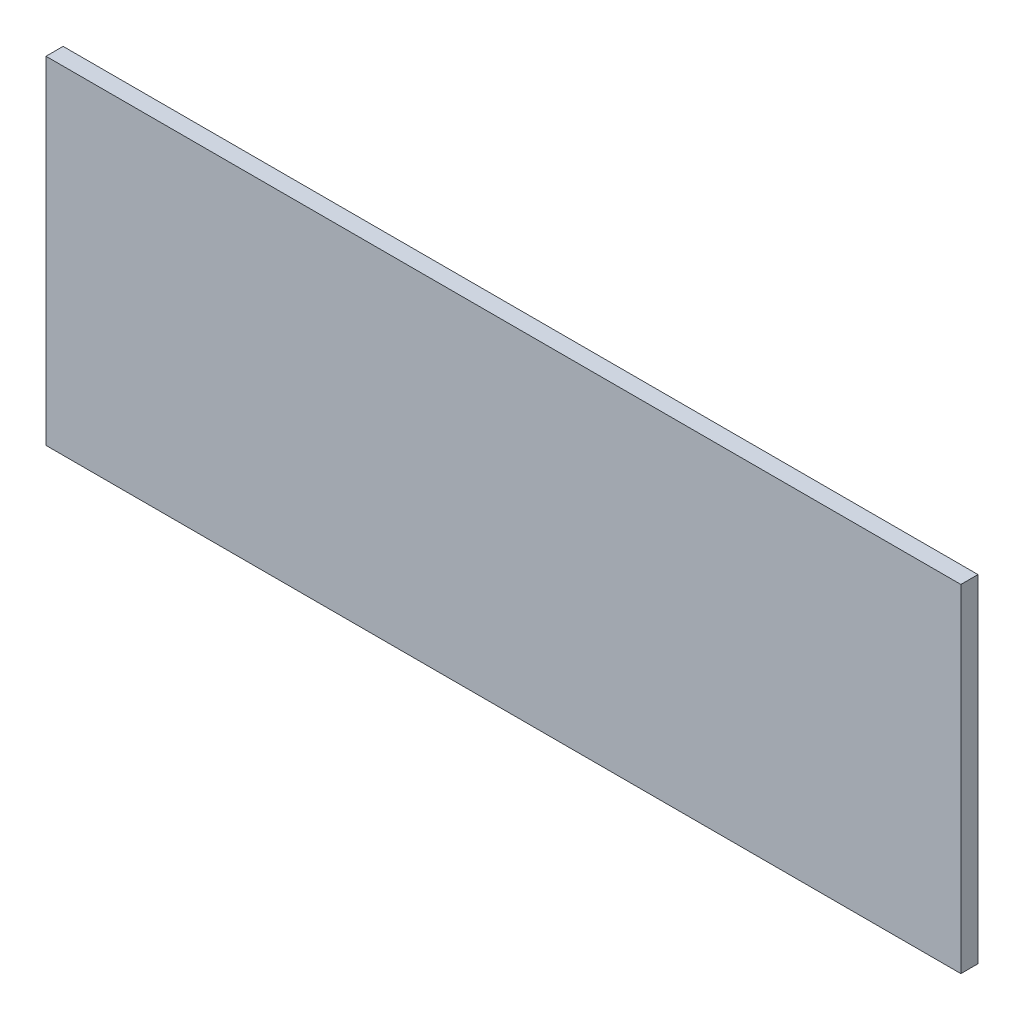
ISO-10303-21;
HEADER;
FILE_DESCRIPTION(('STEP AP214'),'2;1');
FILE_NAME('part.step','',(''),(''),'','','');
FILE_SCHEMA(('AUTOMOTIVE_DESIGN { 1 0 10303 214 1 1 1 1 }'));
ENDSEC;
DATA;
#1=APPLICATION_CONTEXT('core data for automotive mechanical design processes');
#2=APPLICATION_PROTOCOL_DEFINITION('international standard','automotive_design',2000,#1);
#3=PRODUCT_CONTEXT('',#1,'mechanical');
#4=PRODUCT('Part','Part','',(#3));
#5=PRODUCT_RELATED_PRODUCT_CATEGORY('part','',(#4));
#6=PRODUCT_DEFINITION_FORMATION('','',#4);
#7=PRODUCT_DEFINITION_CONTEXT('part definition',#1,'design');
#8=PRODUCT_DEFINITION('design','',#6,#7);
#9=PRODUCT_DEFINITION_SHAPE('','',#8);
#10=(LENGTH_UNIT() NAMED_UNIT(*) SI_UNIT(.MILLI.,.METRE.));
#11=(NAMED_UNIT(*) PLANE_ANGLE_UNIT() SI_UNIT($,.RADIAN.));
#12=(NAMED_UNIT(*) SI_UNIT($,.STERADIAN.) SOLID_ANGLE_UNIT());
#13=UNCERTAINTY_MEASURE_WITH_UNIT(LENGTH_MEASURE(1.E-05),#10,'distance_accuracy_value','');
#14=(GEOMETRIC_REPRESENTATION_CONTEXT(3) GLOBAL_UNCERTAINTY_ASSIGNED_CONTEXT((#13)) GLOBAL_UNIT_ASSIGNED_CONTEXT((#10,
#11,#12)) REPRESENTATION_CONTEXT('',''));
#15=CARTESIAN_POINT('',(0.,0.,0.));
#16=DIRECTION('',(0.,0.,1.));
#17=DIRECTION('',(1.,0.,0.));
#18=AXIS2_PLACEMENT_3D('',#15,#16,#17);
#19=CARTESIAN_POINT('',(96.5670013427734,58.8370018005371,0.));
#20=DIRECTION('',(0.,1.,0.));
#21=DIRECTION('',(1.,0.,0.));
#22=AXIS2_PLACEMENT_3D('',#19,#20,#21);
#23=PLANE('',#22);
#24=DIRECTION('',(1.,0.,0.));
#25=VECTOR('',#24,1.);
#26=CARTESIAN_POINT('',(96.5670013427734,58.8370018005371,0.03556));
#27=LINE('',#26,#25);
#28=CARTESIAN_POINT('',(96.5670013427734,58.8370018005371,0.03556));
#29=VERTEX_POINT('',#28);
#30=CARTESIAN_POINT('',(98.4670028686523,58.8370018005371,0.03556));
#31=VERTEX_POINT('',#30);
#32=EDGE_CURVE('E11',#29,#31,#27,.T.);
#33=ORIENTED_EDGE('',*,*,#32,.F.);
#34=DIRECTION('',(0.,0.,1.));
#35=VECTOR('',#34,1.);
#36=CARTESIAN_POINT('',(96.5670013427734,58.8370018005371,0.));
#37=LINE('',#36,#35);
#38=CARTESIAN_POINT('',(96.5670013427734,58.8370018005371,0.));
#39=VERTEX_POINT('',#38);
#40=EDGE_CURVE('E24',#39,#29,#37,.T.);
#41=ORIENTED_EDGE('',*,*,#40,.F.);
#42=DIRECTION('',(1.,0.,0.));
#43=VECTOR('',#42,1.);
#44=CARTESIAN_POINT('',(96.5670013427734,58.8370018005371,0.));
#45=LINE('',#44,#43);
#46=CARTESIAN_POINT('',(98.4670028686523,58.8370018005371,0.));
#47=VERTEX_POINT('',#46);
#48=EDGE_CURVE('E75',#39,#47,#45,.T.);
#49=ORIENTED_EDGE('',*,*,#48,.T.);
#50=DIRECTION('',(0.,0.,1.));
#51=VECTOR('',#50,1.);
#52=CARTESIAN_POINT('',(98.4670028686523,58.8370018005371,0.));
#53=LINE('',#52,#51);
#54=EDGE_CURVE('E37',#47,#31,#53,.T.);
#55=ORIENTED_EDGE('',*,*,#54,.T.);
#56=EDGE_LOOP('',(#33,#41,#49,#55));
#57=FACE_BOUND('',#56,.T.);
#58=ADVANCED_FACE('F17',(#57),#23,.F.);
#59=CARTESIAN_POINT('',(98.4670028686523,58.8370018005371,0.));
#60=DIRECTION('',(-1.,0.,0.));
#61=DIRECTION('',(0.,1.,0.));
#62=AXIS2_PLACEMENT_3D('',#59,#60,#61);
#63=PLANE('',#62);
#64=DIRECTION('',(0.,1.,0.));
#65=VECTOR('',#64,1.);
#66=CARTESIAN_POINT('',(98.4670028686523,58.8370018005371,0.03556));
#67=LINE('',#66,#65);
#68=CARTESIAN_POINT('',(98.4670028686523,59.5369987487793,0.03556));
#69=VERTEX_POINT('',#68);
#70=EDGE_CURVE('E83',#31,#69,#67,.T.);
#71=ORIENTED_EDGE('',*,*,#70,.F.);
#72=ORIENTED_EDGE('',*,*,#54,.F.);
#73=DIRECTION('',(0.,1.,0.));
#74=VECTOR('',#73,1.);
#75=CARTESIAN_POINT('',(98.4670028686523,58.8370018005371,0.));
#76=LINE('',#75,#74);
#77=CARTESIAN_POINT('',(98.4670028686523,59.5369987487793,0.));
#78=VERTEX_POINT('',#77);
#79=EDGE_CURVE('E81',#47,#78,#76,.T.);
#80=ORIENTED_EDGE('',*,*,#79,.T.);
#81=DIRECTION('',(0.,0.,1.));
#82=VECTOR('',#81,1.);
#83=CARTESIAN_POINT('',(98.4670028686523,59.5369987487793,0.));
#84=LINE('',#83,#82);
#85=EDGE_CURVE('E67',#78,#69,#84,.T.);
#86=ORIENTED_EDGE('',*,*,#85,.T.);
#87=EDGE_LOOP('',(#71,#72,#80,#86));
#88=FACE_BOUND('',#87,.T.);
#89=ADVANCED_FACE('F89',(#88),#63,.F.);
#90=CARTESIAN_POINT('',(98.4670028686523,59.5369987487793,0.));
#91=DIRECTION('',(0.,-1.,0.));
#92=DIRECTION('',(-1.,0.,0.));
#93=AXIS2_PLACEMENT_3D('',#90,#91,#92);
#94=PLANE('',#93);
#95=DIRECTION('',(-1.,0.,0.));
#96=VECTOR('',#95,1.);
#97=CARTESIAN_POINT('',(98.4670028686523,59.5369987487793,0.03556));
#98=LINE('',#97,#96);
#99=CARTESIAN_POINT('',(96.5670013427734,59.5369987487793,0.03556));
#100=VERTEX_POINT('',#99);
#101=EDGE_CURVE('E71',#69,#100,#98,.T.);
#102=ORIENTED_EDGE('',*,*,#101,.F.);
#103=ORIENTED_EDGE('',*,*,#85,.F.);
#104=DIRECTION('',(-1.,0.,0.));
#105=VECTOR('',#104,1.);
#106=CARTESIAN_POINT('',(98.4670028686523,59.5369987487793,0.));
#107=LINE('',#106,#105);
#108=CARTESIAN_POINT('',(96.5670013427734,59.5369987487793,0.));
#109=VERTEX_POINT('',#108);
#110=EDGE_CURVE('E63',#78,#109,#107,.T.);
#111=ORIENTED_EDGE('',*,*,#110,.T.);
#112=DIRECTION('',(0.,0.,1.));
#113=VECTOR('',#112,1.);
#114=CARTESIAN_POINT('',(96.5670013427734,59.5369987487793,0.));
#115=LINE('',#114,#113);
#116=EDGE_CURVE('E53',#109,#100,#115,.T.);
#117=ORIENTED_EDGE('',*,*,#116,.T.);
#118=EDGE_LOOP('',(#102,#103,#111,#117));
#119=FACE_BOUND('',#118,.T.);
#120=ADVANCED_FACE('F66',(#119),#94,.F.);
#121=CARTESIAN_POINT('',(96.5670013427734,59.5369987487793,0.));
#122=DIRECTION('',(1.,0.,0.));
#123=DIRECTION('',(0.,-1.,0.));
#124=AXIS2_PLACEMENT_3D('',#121,#122,#123);
#125=PLANE('',#124);
#126=DIRECTION('',(0.,-1.,0.));
#127=VECTOR('',#126,1.);
#128=CARTESIAN_POINT('',(96.5670013427734,59.5369987487793,0.03556));
#129=LINE('',#128,#127);
#130=EDGE_CURVE('E59',#100,#29,#129,.T.);
#131=ORIENTED_EDGE('',*,*,#130,.F.);
#132=ORIENTED_EDGE('',*,*,#116,.F.);
#133=DIRECTION('',(0.,-1.,0.));
#134=VECTOR('',#133,1.);
#135=CARTESIAN_POINT('',(96.5670013427734,59.5369987487793,0.));
#136=LINE('',#135,#134);
#137=EDGE_CURVE('E57',#109,#39,#136,.T.);
#138=ORIENTED_EDGE('',*,*,#137,.T.);
#139=ORIENTED_EDGE('',*,*,#40,.T.);
#140=EDGE_LOOP('',(#131,#132,#138,#139));
#141=FACE_BOUND('',#140,.T.);
#142=ADVANCED_FACE('F55',(#141),#125,.F.);
#143=CARTESIAN_POINT('',(96.5670013427734,58.8370018005371,0.));
#144=DIRECTION('',(0.,0.,-1.));
#145=DIRECTION('',(-1.,0.,0.));
#146=AXIS2_PLACEMENT_3D('',#143,#144,#145);
#147=PLANE('',#146);
#148=ORIENTED_EDGE('',*,*,#137,.F.);
#149=ORIENTED_EDGE('',*,*,#110,.F.);
#150=ORIENTED_EDGE('',*,*,#79,.F.);
#151=ORIENTED_EDGE('',*,*,#48,.F.);
#152=EDGE_LOOP('',(#148,#149,#150,#151));
#153=FACE_BOUND('',#152,.T.);
#154=ADVANCED_FACE('F74',(#153),#147,.T.);
#155=CARTESIAN_POINT('',(96.5670013427734,58.8370018005371,0.03556));
#156=DIRECTION('',(0.,0.,-1.));
#157=DIRECTION('',(-1.,0.,0.));
#158=AXIS2_PLACEMENT_3D('',#155,#156,#157);
#159=PLANE('',#158);
#160=ORIENTED_EDGE('',*,*,#32,.T.);
#161=ORIENTED_EDGE('',*,*,#70,.T.);
#162=ORIENTED_EDGE('',*,*,#101,.T.);
#163=ORIENTED_EDGE('',*,*,#130,.T.);
#164=EDGE_LOOP('',(#160,#161,#162,#163));
#165=FACE_BOUND('',#164,.T.);
#166=ADVANCED_FACE('F91',(#165),#159,.F.);
#167=CLOSED_SHELL('',(#58,#89,#120,#142,#154,#166));
#168=MANIFOLD_SOLID_BREP('B1',#167);
#169=ADVANCED_BREP_SHAPE_REPRESENTATION('',(#18,#168),#14);
#170=SHAPE_DEFINITION_REPRESENTATION(#9,#169);
ENDSEC;
END-ISO-10303-21;
